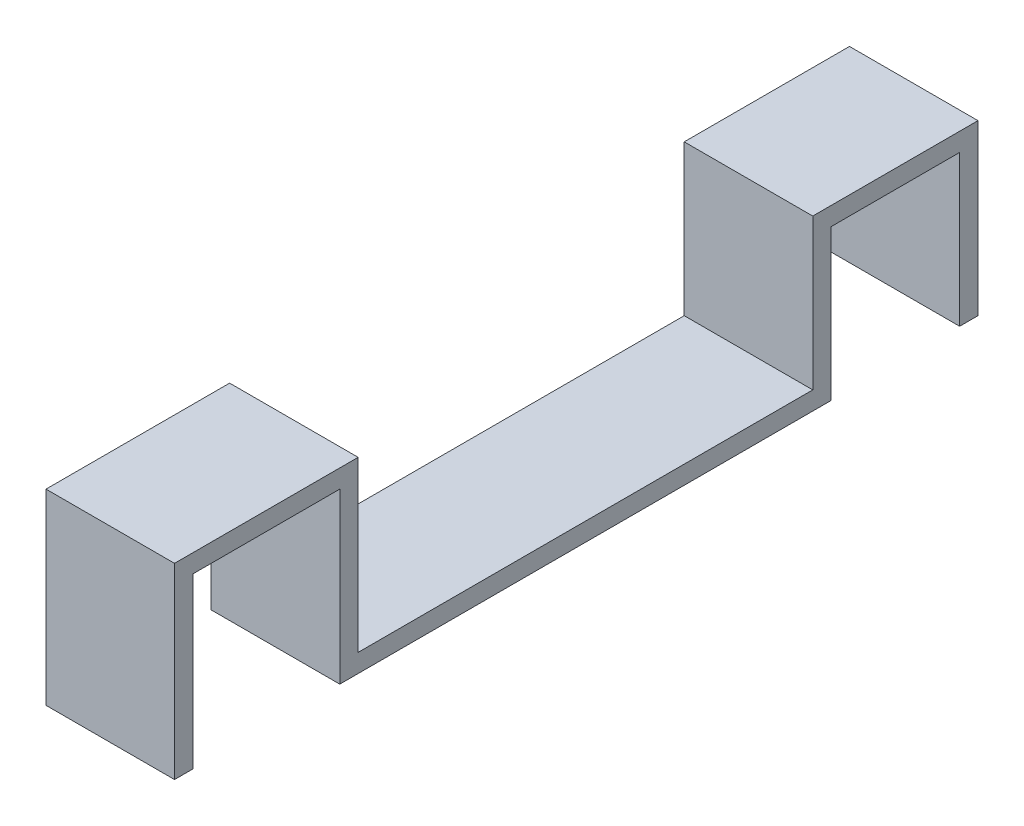
ISO-10303-21;
HEADER;
FILE_DESCRIPTION(('STEP AP214'),'2;1');
FILE_NAME('part.step','',(''),(''),'','','');
FILE_SCHEMA(('AUTOMOTIVE_DESIGN { 1 0 10303 214 1 1 1 1 }'));
ENDSEC;
DATA;
#1=APPLICATION_CONTEXT('core data for automotive mechanical design processes');
#2=APPLICATION_PROTOCOL_DEFINITION('international standard','automotive_design',2000,#1);
#3=PRODUCT_CONTEXT('',#1,'mechanical');
#4=PRODUCT('Part','Part','',(#3));
#5=PRODUCT_RELATED_PRODUCT_CATEGORY('part','',(#4));
#6=PRODUCT_DEFINITION_FORMATION('','',#4);
#7=PRODUCT_DEFINITION_CONTEXT('part definition',#1,'design');
#8=PRODUCT_DEFINITION('design','',#6,#7);
#9=PRODUCT_DEFINITION_SHAPE('','',#8);
#10=(LENGTH_UNIT() NAMED_UNIT(*) SI_UNIT(.MILLI.,.METRE.));
#11=(NAMED_UNIT(*) PLANE_ANGLE_UNIT() SI_UNIT($,.RADIAN.));
#12=(NAMED_UNIT(*) SI_UNIT($,.STERADIAN.) SOLID_ANGLE_UNIT());
#13=UNCERTAINTY_MEASURE_WITH_UNIT(LENGTH_MEASURE(1.E-05),#10,'distance_accuracy_value','');
#14=(GEOMETRIC_REPRESENTATION_CONTEXT(3) GLOBAL_UNCERTAINTY_ASSIGNED_CONTEXT((#13)) GLOBAL_UNIT_ASSIGNED_CONTEXT((#10,
#11,#12)) REPRESENTATION_CONTEXT('',''));
#15=CARTESIAN_POINT('',(0.,0.,0.));
#16=DIRECTION('',(0.,0.,1.));
#17=DIRECTION('',(1.,0.,0.));
#18=AXIS2_PLACEMENT_3D('',#15,#16,#17);
#19=CARTESIAN_POINT('',(-17.5,46.,111.9));
#20=DIRECTION('',(0.,1.,0.));
#21=DIRECTION('',(0.,0.,1.));
#22=AXIS2_PLACEMENT_3D('',#19,#20,#21);
#23=PLANE('',#22);
#24=DIRECTION('',(1.,0.,0.));
#25=VECTOR('',#24,1.);
#26=CARTESIAN_POINT('',(-17.5,46.,106.9));
#27=LINE('',#26,#25);
#28=CARTESIAN_POINT('',(-17.5,46.,106.9));
#29=VERTEX_POINT('',#28);
#30=CARTESIAN_POINT('',(17.5,46.,106.9));
#31=VERTEX_POINT('',#30);
#32=EDGE_CURVE('E172',#29,#31,#27,.T.);
#33=ORIENTED_EDGE('',*,*,#32,.F.);
#34=DIRECTION('',(0.,0.,-1.));
#35=VECTOR('',#34,1.);
#36=CARTESIAN_POINT('',(-17.5,46.,111.9));
#37=LINE('',#36,#35);
#38=CARTESIAN_POINT('',(-17.5,46.,66.9));
#39=VERTEX_POINT('',#38);
#40=EDGE_CURVE('E52',#29,#39,#37,.T.);
#41=ORIENTED_EDGE('',*,*,#40,.T.);
#42=DIRECTION('',(1.,0.,0.));
#43=VECTOR('',#42,1.);
#44=CARTESIAN_POINT('',(-17.5,46.,66.9));
#45=LINE('',#44,#43);
#46=CARTESIAN_POINT('',(17.5,46.,66.9));
#47=VERTEX_POINT('',#46);
#48=EDGE_CURVE('E177',#39,#47,#45,.T.);
#49=ORIENTED_EDGE('',*,*,#48,.T.);
#50=DIRECTION('',(0.,0.,-1.));
#51=VECTOR('',#50,1.);
#52=CARTESIAN_POINT('',(17.5,46.,111.9));
#53=LINE('',#52,#51);
#54=EDGE_CURVE('E190',#31,#47,#53,.T.);
#55=ORIENTED_EDGE('',*,*,#54,.F.);
#56=EDGE_LOOP('',(#33,#41,#49,#55));
#57=FACE_BOUND('',#56,.T.);
#58=ADVANCED_FACE('F35',(#57),#23,.F.);
#59=CARTESIAN_POINT('',(0.,0.,66.9));
#60=DIRECTION('',(0.,0.,-1.));
#61=DIRECTION('',(-1.,0.,0.));
#62=AXIS2_PLACEMENT_3D('',#59,#60,#61);
#63=PLANE('',#62);
#64=ORIENTED_EDGE('',*,*,#48,.F.);
#65=DIRECTION('',(0.,-1.,0.));
#66=VECTOR('',#65,1.);
#67=CARTESIAN_POINT('',(-17.5,0.,66.9));
#68=LINE('',#67,#66);
#69=CARTESIAN_POINT('',(-17.5,0.,66.9));
#70=VERTEX_POINT('',#69);
#71=EDGE_CURVE('E207',#39,#70,#68,.T.);
#72=ORIENTED_EDGE('',*,*,#71,.T.);
#73=DIRECTION('',(1.,0.,0.));
#74=VECTOR('',#73,1.);
#75=CARTESIAN_POINT('',(-17.5,0.,66.9));
#76=LINE('',#75,#74);
#77=CARTESIAN_POINT('',(17.5,0.,66.9));
#78=VERTEX_POINT('',#77);
#79=EDGE_CURVE('E209',#70,#78,#76,.T.);
#80=ORIENTED_EDGE('',*,*,#79,.T.);
#81=DIRECTION('',(0.,1.,0.));
#82=VECTOR('',#81,1.);
#83=CARTESIAN_POINT('',(17.5,0.,66.9));
#84=LINE('',#83,#82);
#85=EDGE_CURVE('E212',#78,#47,#84,.T.);
#86=ORIENTED_EDGE('',*,*,#85,.T.);
#87=EDGE_LOOP('',(#64,#72,#80,#86));
#88=FACE_BOUND('',#87,.T.);
#89=ADVANCED_FACE('F325',(#88),#63,.F.);
#90=CARTESIAN_POINT('',(0.,5.,0.));
#91=DIRECTION('',(0.,1.,0.));
#92=DIRECTION('',(0.,0.,1.));
#93=AXIS2_PLACEMENT_3D('',#90,#91,#92);
#94=PLANE('',#93);
#95=DIRECTION('',(0.,0.,-1.));
#96=VECTOR('',#95,1.);
#97=CARTESIAN_POINT('',(-17.5,5.,61.9));
#98=LINE('',#97,#96);
#99=CARTESIAN_POINT('',(-17.5,5.,61.9));
#100=VERTEX_POINT('',#99);
#101=CARTESIAN_POINT('',(-17.5,5.,-61.9));
#102=VERTEX_POINT('',#101);
#103=EDGE_CURVE('E11',#100,#102,#98,.T.);
#104=ORIENTED_EDGE('',*,*,#103,.F.);
#105=DIRECTION('',(-1.,0.,0.));
#106=VECTOR('',#105,1.);
#107=CARTESIAN_POINT('',(-17.5,5.,61.9));
#108=LINE('',#107,#106);
#109=CARTESIAN_POINT('',(17.5,5.,61.9));
#110=VERTEX_POINT('',#109);
#111=EDGE_CURVE('E194',#110,#100,#108,.T.);
#112=ORIENTED_EDGE('',*,*,#111,.F.);
#113=DIRECTION('',(0.,0.,-1.));
#114=VECTOR('',#113,1.);
#115=CARTESIAN_POINT('',(17.5,5.,61.9));
#116=LINE('',#115,#114);
#117=CARTESIAN_POINT('',(17.5,5.,-61.9));
#118=VERTEX_POINT('',#117);
#119=EDGE_CURVE('E44',#110,#118,#116,.T.);
#120=ORIENTED_EDGE('',*,*,#119,.T.);
#121=DIRECTION('',(1.,0.,0.));
#122=VECTOR('',#121,1.);
#123=CARTESIAN_POINT('',(0.,5.,-61.9));
#124=LINE('',#123,#122);
#125=EDGE_CURVE('E255',#102,#118,#124,.T.);
#126=ORIENTED_EDGE('',*,*,#125,.F.);
#127=EDGE_LOOP('',(#104,#112,#120,#126));
#128=FACE_BOUND('',#127,.T.);
#129=ADVANCED_FACE('F308',(#128),#94,.T.);
#130=CARTESIAN_POINT('',(17.5,5.,61.9));
#131=DIRECTION('',(-1.,0.,0.));
#132=DIRECTION('',(0.,0.,1.));
#133=AXIS2_PLACEMENT_3D('',#130,#131,#132);
#134=PLANE('',#133);
#135=DIRECTION('',(0.,0.,-1.));
#136=VECTOR('',#135,1.);
#137=CARTESIAN_POINT('',(17.5,0.,61.9));
#138=LINE('',#137,#136);
#139=CARTESIAN_POINT('',(17.5,0.,-66.9));
#140=VERTEX_POINT('',#139);
#141=EDGE_CURVE('E270',#78,#140,#138,.T.);
#142=ORIENTED_EDGE('',*,*,#141,.T.);
#143=DIRECTION('',(0.,-1.,0.));
#144=VECTOR('',#143,1.);
#145=CARTESIAN_POINT('',(17.5,5.,-66.9));
#146=LINE('',#145,#144);
#147=CARTESIAN_POINT('',(17.5,41.,-66.9));
#148=VERTEX_POINT('',#147);
#149=EDGE_CURVE('E262',#148,#140,#146,.T.);
#150=ORIENTED_EDGE('',*,*,#149,.F.);
#151=DIRECTION('',(0.,0.,1.));
#152=VECTOR('',#151,1.);
#153=CARTESIAN_POINT('',(17.5,41.,-106.9));
#154=LINE('',#153,#152);
#155=CARTESIAN_POINT('',(17.5,41.,-101.9));
#156=VERTEX_POINT('',#155);
#157=EDGE_CURVE('E60',#156,#148,#154,.T.);
#158=ORIENTED_EDGE('',*,*,#157,.F.);
#159=DIRECTION('',(0.,1.,0.));
#160=VECTOR('',#159,1.);
#161=CARTESIAN_POINT('',(17.5,0.,-101.9));
#162=LINE('',#161,#160);
#163=CARTESIAN_POINT('',(17.5,0.,-101.9));
#164=VERTEX_POINT('',#163);
#165=EDGE_CURVE('E230',#164,#156,#162,.T.);
#166=ORIENTED_EDGE('',*,*,#165,.F.);
#167=DIRECTION('',(0.,0.,-1.));
#168=VECTOR('',#167,1.);
#169=CARTESIAN_POINT('',(17.5,0.,-101.9));
#170=LINE('',#169,#168);
#171=CARTESIAN_POINT('',(17.5,0.,-106.9));
#172=VERTEX_POINT('',#171);
#173=EDGE_CURVE('E216',#164,#172,#170,.T.);
#174=ORIENTED_EDGE('',*,*,#173,.T.);
#175=DIRECTION('',(0.,-1.,0.));
#176=VECTOR('',#175,1.);
#177=CARTESIAN_POINT('',(17.5,46.,-106.9));
#178=LINE('',#177,#176);
#179=CARTESIAN_POINT('',(17.5,46.,-106.9));
#180=VERTEX_POINT('',#179);
#181=EDGE_CURVE('E237',#180,#172,#178,.T.);
#182=ORIENTED_EDGE('',*,*,#181,.F.);
#183=DIRECTION('',(0.,0.,1.));
#184=VECTOR('',#183,1.);
#185=CARTESIAN_POINT('',(17.5,46.,-66.9));
#186=LINE('',#185,#184);
#187=CARTESIAN_POINT('',(17.5,46.,-61.9));
#188=VERTEX_POINT('',#187);
#189=EDGE_CURVE('E258',#180,#188,#186,.T.);
#190=ORIENTED_EDGE('',*,*,#189,.T.);
#191=DIRECTION('',(0.,1.,0.));
#192=VECTOR('',#191,1.);
#193=CARTESIAN_POINT('',(17.5,0.,-61.9));
#194=LINE('',#193,#192);
#195=EDGE_CURVE('E252',#118,#188,#194,.T.);
#196=ORIENTED_EDGE('',*,*,#195,.F.);
#197=ORIENTED_EDGE('',*,*,#119,.F.);
#198=DIRECTION('',(0.,-1.,0.));
#199=VECTOR('',#198,1.);
#200=CARTESIAN_POINT('',(17.5,51.,61.9));
#201=LINE('',#200,#199);
#202=CARTESIAN_POINT('',(17.5,51.,61.9));
#203=VERTEX_POINT('',#202);
#204=EDGE_CURVE('E205',#203,#110,#201,.T.);
#205=ORIENTED_EDGE('',*,*,#204,.F.);
#206=DIRECTION('',(0.,0.,-1.));
#207=VECTOR('',#206,1.);
#208=CARTESIAN_POINT('',(17.5,51.,61.9));
#209=LINE('',#208,#207);
#210=CARTESIAN_POINT('',(17.5,51.,111.9));
#211=VERTEX_POINT('',#210);
#212=EDGE_CURVE('E195',#211,#203,#209,.T.);
#213=ORIENTED_EDGE('',*,*,#212,.F.);
#214=DIRECTION('',(0.,1.,0.));
#215=VECTOR('',#214,1.);
#216=CARTESIAN_POINT('',(17.5,46.,111.9));
#217=LINE('',#216,#215);
#218=CARTESIAN_POINT('',(17.5,0.,111.9));
#219=VERTEX_POINT('',#218);
#220=EDGE_CURVE('E188',#219,#211,#217,.T.);
#221=ORIENTED_EDGE('',*,*,#220,.F.);
#222=DIRECTION('',(0.,0.,1.));
#223=VECTOR('',#222,1.);
#224=CARTESIAN_POINT('',(17.5,0.,111.9));
#225=LINE('',#224,#223);
#226=CARTESIAN_POINT('',(17.5,0.,106.9));
#227=VERTEX_POINT('',#226);
#228=EDGE_CURVE('E162',#227,#219,#225,.T.);
#229=ORIENTED_EDGE('',*,*,#228,.F.);
#230=DIRECTION('',(0.,1.,0.));
#231=VECTOR('',#230,1.);
#232=CARTESIAN_POINT('',(17.5,0.,106.9));
#233=LINE('',#232,#231);
#234=EDGE_CURVE('E158',#227,#31,#233,.T.);
#235=ORIENTED_EDGE('',*,*,#234,.T.);
#236=ORIENTED_EDGE('',*,*,#54,.T.);
#237=ORIENTED_EDGE('',*,*,#85,.F.);
#238=EDGE_LOOP('',(#142,#150,#158,#166,#174,#182,#190,#196,#197,#205,#213,#221,#229,#235,#236,#237));
#239=FACE_BOUND('',#238,.T.);
#240=ADVANCED_FACE('F37',(#239),#134,.F.);
#241=CARTESIAN_POINT('',(-17.5,5.,61.9));
#242=DIRECTION('',(-1.,0.,0.));
#243=DIRECTION('',(0.,0.,1.));
#244=AXIS2_PLACEMENT_3D('',#241,#242,#243);
#245=PLANE('',#244);
#246=DIRECTION('',(0.,0.,-1.));
#247=VECTOR('',#246,1.);
#248=CARTESIAN_POINT('',(-17.5,0.,61.9));
#249=LINE('',#248,#247);
#250=CARTESIAN_POINT('',(-17.5,0.,-66.9));
#251=VERTEX_POINT('',#250);
#252=EDGE_CURVE('E39',#70,#251,#249,.T.);
#253=ORIENTED_EDGE('',*,*,#252,.F.);
#254=ORIENTED_EDGE('',*,*,#71,.F.);
#255=ORIENTED_EDGE('',*,*,#40,.F.);
#256=DIRECTION('',(0.,1.,0.));
#257=VECTOR('',#256,1.);
#258=CARTESIAN_POINT('',(-17.5,0.,106.9));
#259=LINE('',#258,#257);
#260=CARTESIAN_POINT('',(-17.5,0.,106.9));
#261=VERTEX_POINT('',#260);
#262=EDGE_CURVE('E156',#261,#29,#259,.T.);
#263=ORIENTED_EDGE('',*,*,#262,.F.);
#264=DIRECTION('',(0.,0.,-1.));
#265=VECTOR('',#264,1.);
#266=CARTESIAN_POINT('',(-17.5,0.,111.9));
#267=LINE('',#266,#265);
#268=CARTESIAN_POINT('',(-17.5,0.,111.9));
#269=VERTEX_POINT('',#268);
#270=EDGE_CURVE('E163',#269,#261,#267,.T.);
#271=ORIENTED_EDGE('',*,*,#270,.F.);
#272=DIRECTION('',(0.,-1.,0.));
#273=VECTOR('',#272,1.);
#274=CARTESIAN_POINT('',(-17.5,51.,111.9));
#275=LINE('',#274,#273);
#276=CARTESIAN_POINT('',(-17.5,51.,111.9));
#277=VERTEX_POINT('',#276);
#278=EDGE_CURVE('E186',#277,#269,#275,.T.);
#279=ORIENTED_EDGE('',*,*,#278,.F.);
#280=DIRECTION('',(0.,0.,1.));
#281=VECTOR('',#280,1.);
#282=CARTESIAN_POINT('',(-17.5,51.,66.9));
#283=LINE('',#282,#281);
#284=CARTESIAN_POINT('',(-17.5,51.,61.9));
#285=VERTEX_POINT('',#284);
#286=EDGE_CURVE('E199',#285,#277,#283,.T.);
#287=ORIENTED_EDGE('',*,*,#286,.F.);
#288=DIRECTION('',(0.,-1.,0.));
#289=VECTOR('',#288,1.);
#290=CARTESIAN_POINT('',(-17.5,51.,61.9));
#291=LINE('',#290,#289);
#292=EDGE_CURVE('E201',#285,#100,#291,.T.);
#293=ORIENTED_EDGE('',*,*,#292,.T.);
#294=ORIENTED_EDGE('',*,*,#103,.T.);
#295=DIRECTION('',(0.,-1.,0.));
#296=VECTOR('',#295,1.);
#297=CARTESIAN_POINT('',(-17.5,0.,-61.9));
#298=LINE('',#297,#296);
#299=CARTESIAN_POINT('',(-17.5,46.,-61.9));
#300=VERTEX_POINT('',#299);
#301=EDGE_CURVE('E246',#300,#102,#298,.T.);
#302=ORIENTED_EDGE('',*,*,#301,.F.);
#303=DIRECTION('',(0.,0.,1.));
#304=VECTOR('',#303,1.);
#305=CARTESIAN_POINT('',(-17.5,46.,-66.9));
#306=LINE('',#305,#304);
#307=CARTESIAN_POINT('',(-17.5,46.,-106.9));
#308=VERTEX_POINT('',#307);
#309=EDGE_CURVE('E260',#308,#300,#306,.T.);
#310=ORIENTED_EDGE('',*,*,#309,.F.);
#311=DIRECTION('',(0.,1.,0.));
#312=VECTOR('',#311,1.);
#313=CARTESIAN_POINT('',(-17.5,41.,-106.9));
#314=LINE('',#313,#312);
#315=CARTESIAN_POINT('',(-17.5,0.,-106.9));
#316=VERTEX_POINT('',#315);
#317=EDGE_CURVE('E239',#316,#308,#314,.T.);
#318=ORIENTED_EDGE('',*,*,#317,.F.);
#319=DIRECTION('',(0.,0.,1.));
#320=VECTOR('',#319,1.);
#321=CARTESIAN_POINT('',(-17.5,0.,-106.9));
#322=LINE('',#321,#320);
#323=CARTESIAN_POINT('',(-17.5,0.,-101.9));
#324=VERTEX_POINT('',#323);
#325=EDGE_CURVE('E222',#316,#324,#322,.T.);
#326=ORIENTED_EDGE('',*,*,#325,.T.);
#327=DIRECTION('',(0.,1.,0.));
#328=VECTOR('',#327,1.);
#329=CARTESIAN_POINT('',(-17.5,0.,-101.9));
#330=LINE('',#329,#328);
#331=CARTESIAN_POINT('',(-17.5,41.,-101.9));
#332=VERTEX_POINT('',#331);
#333=EDGE_CURVE('E228',#324,#332,#330,.T.);
#334=ORIENTED_EDGE('',*,*,#333,.T.);
#335=DIRECTION('',(0.,0.,1.));
#336=VECTOR('',#335,1.);
#337=CARTESIAN_POINT('',(-17.5,41.,-106.9));
#338=LINE('',#337,#336);
#339=CARTESIAN_POINT('',(-17.5,41.,-66.9));
#340=VERTEX_POINT('',#339);
#341=EDGE_CURVE('E242',#332,#340,#338,.T.);
#342=ORIENTED_EDGE('',*,*,#341,.T.);
#343=DIRECTION('',(0.,1.,0.));
#344=VECTOR('',#343,1.);
#345=CARTESIAN_POINT('',(-17.5,5.,-66.9));
#346=LINE('',#345,#344);
#347=EDGE_CURVE('E267',#251,#340,#346,.T.);
#348=ORIENTED_EDGE('',*,*,#347,.F.);
#349=EDGE_LOOP('',(#253,#254,#255,#263,#271,#279,#287,#293,#294,#302,#310,#318,#326,#334,#342,#348));
#350=FACE_BOUND('',#349,.T.);
#351=ADVANCED_FACE('F175',(#350),#245,.T.);
#352=CARTESIAN_POINT('',(0.,0.,0.));
#353=DIRECTION('',(0.,1.,0.));
#354=DIRECTION('',(0.,0.,1.));
#355=AXIS2_PLACEMENT_3D('',#352,#353,#354);
#356=PLANE('',#355);
#357=ORIENTED_EDGE('',*,*,#141,.F.);
#358=ORIENTED_EDGE('',*,*,#79,.F.);
#359=ORIENTED_EDGE('',*,*,#252,.T.);
#360=DIRECTION('',(-1.,0.,0.));
#361=VECTOR('',#360,1.);
#362=CARTESIAN_POINT('',(17.5,0.,-66.9));
#363=LINE('',#362,#361);
#364=EDGE_CURVE('E264',#140,#251,#363,.T.);
#365=ORIENTED_EDGE('',*,*,#364,.F.);
#366=EDGE_LOOP('',(#357,#358,#359,#365));
#367=FACE_BOUND('',#366,.T.);
#368=ADVANCED_FACE('F278',(#367),#356,.F.);
#369=CARTESIAN_POINT('',(0.,0.,-66.9));
#370=DIRECTION('',(0.,0.,-1.));
#371=DIRECTION('',(-1.,0.,0.));
#372=AXIS2_PLACEMENT_3D('',#369,#370,#371);
#373=PLANE('',#372);
#374=DIRECTION('',(-1.,0.,0.));
#375=VECTOR('',#374,1.);
#376=CARTESIAN_POINT('',(17.5,41.,-66.9));
#377=LINE('',#376,#375);
#378=EDGE_CURVE('E232',#148,#340,#377,.T.);
#379=ORIENTED_EDGE('',*,*,#378,.F.);
#380=ORIENTED_EDGE('',*,*,#149,.T.);
#381=ORIENTED_EDGE('',*,*,#364,.T.);
#382=ORIENTED_EDGE('',*,*,#347,.T.);
#383=EDGE_LOOP('',(#379,#380,#381,#382));
#384=FACE_BOUND('',#383,.T.);
#385=ADVANCED_FACE('F281',(#384),#373,.T.);
#386=CARTESIAN_POINT('',(0.,46.,-66.9));
#387=DIRECTION('',(0.,1.,0.));
#388=DIRECTION('',(0.,0.,1.));
#389=AXIS2_PLACEMENT_3D('',#386,#387,#388);
#390=PLANE('',#389);
#391=DIRECTION('',(-1.,0.,0.));
#392=VECTOR('',#391,1.);
#393=CARTESIAN_POINT('',(0.,46.,-61.9));
#394=LINE('',#393,#392);
#395=EDGE_CURVE('E249',#188,#300,#394,.T.);
#396=ORIENTED_EDGE('',*,*,#395,.F.);
#397=ORIENTED_EDGE('',*,*,#189,.F.);
#398=DIRECTION('',(1.,0.,0.));
#399=VECTOR('',#398,1.);
#400=CARTESIAN_POINT('',(-17.5,46.,-106.9));
#401=LINE('',#400,#399);
#402=EDGE_CURVE('E234',#308,#180,#401,.T.);
#403=ORIENTED_EDGE('',*,*,#402,.F.);
#404=ORIENTED_EDGE('',*,*,#309,.T.);
#405=EDGE_LOOP('',(#396,#397,#403,#404));
#406=FACE_BOUND('',#405,.T.);
#407=ADVANCED_FACE('F301',(#406),#390,.T.);
#408=CARTESIAN_POINT('',(0.,0.,-61.9));
#409=DIRECTION('',(0.,0.,-1.));
#410=DIRECTION('',(-1.,0.,0.));
#411=AXIS2_PLACEMENT_3D('',#408,#409,#410);
#412=PLANE('',#411);
#413=ORIENTED_EDGE('',*,*,#301,.T.);
#414=ORIENTED_EDGE('',*,*,#125,.T.);
#415=ORIENTED_EDGE('',*,*,#195,.T.);
#416=ORIENTED_EDGE('',*,*,#395,.T.);
#417=EDGE_LOOP('',(#413,#414,#415,#416));
#418=FACE_BOUND('',#417,.T.);
#419=ADVANCED_FACE('F304',(#418),#412,.F.);
#420=CARTESIAN_POINT('',(17.5,41.,-106.9));
#421=DIRECTION('',(0.,1.,0.));
#422=DIRECTION('',(0.,0.,1.));
#423=AXIS2_PLACEMENT_3D('',#420,#421,#422);
#424=PLANE('',#423);
#425=ORIENTED_EDGE('',*,*,#341,.F.);
#426=DIRECTION('',(1.,0.,0.));
#427=VECTOR('',#426,1.);
#428=CARTESIAN_POINT('',(-17.5,41.,-101.9));
#429=LINE('',#428,#427);
#430=EDGE_CURVE('E215',#332,#156,#429,.T.);
#431=ORIENTED_EDGE('',*,*,#430,.T.);
#432=ORIENTED_EDGE('',*,*,#157,.T.);
#433=ORIENTED_EDGE('',*,*,#378,.T.);
#434=EDGE_LOOP('',(#425,#431,#432,#433));
#435=FACE_BOUND('',#434,.T.);
#436=ADVANCED_FACE('F284',(#435),#424,.F.);
#437=CARTESIAN_POINT('',(0.,0.,-106.9));
#438=DIRECTION('',(0.,0.,-1.));
#439=DIRECTION('',(-1.,0.,0.));
#440=AXIS2_PLACEMENT_3D('',#437,#438,#439);
#441=PLANE('',#440);
#442=ORIENTED_EDGE('',*,*,#402,.T.);
#443=ORIENTED_EDGE('',*,*,#181,.T.);
#444=DIRECTION('',(-1.,0.,0.));
#445=VECTOR('',#444,1.);
#446=CARTESIAN_POINT('',(17.5,0.,-106.9));
#447=LINE('',#446,#445);
#448=EDGE_CURVE('E219',#172,#316,#447,.T.);
#449=ORIENTED_EDGE('',*,*,#448,.T.);
#450=ORIENTED_EDGE('',*,*,#317,.T.);
#451=EDGE_LOOP('',(#442,#443,#449,#450));
#452=FACE_BOUND('',#451,.T.);
#453=ADVANCED_FACE('F295',(#452),#441,.T.);
#454=CARTESIAN_POINT('',(-17.5,0.,-101.9));
#455=DIRECTION('',(0.,0.,1.));
#456=DIRECTION('',(1.,0.,0.));
#457=AXIS2_PLACEMENT_3D('',#454,#455,#456);
#458=PLANE('',#457);
#459=ORIENTED_EDGE('',*,*,#430,.F.);
#460=ORIENTED_EDGE('',*,*,#333,.F.);
#461=DIRECTION('',(1.,0.,0.));
#462=VECTOR('',#461,1.);
#463=CARTESIAN_POINT('',(-17.5,0.,-101.9));
#464=LINE('',#463,#462);
#465=EDGE_CURVE('E225',#324,#164,#464,.T.);
#466=ORIENTED_EDGE('',*,*,#465,.T.);
#467=ORIENTED_EDGE('',*,*,#165,.T.);
#468=EDGE_LOOP('',(#459,#460,#466,#467));
#469=FACE_BOUND('',#468,.T.);
#470=ADVANCED_FACE('F293',(#469),#458,.T.);
#471=CARTESIAN_POINT('',(0.,0.,0.));
#472=DIRECTION('',(0.,1.,0.));
#473=DIRECTION('',(0.,0.,1.));
#474=AXIS2_PLACEMENT_3D('',#471,#472,#473);
#475=PLANE('',#474);
#476=ORIENTED_EDGE('',*,*,#173,.F.);
#477=ORIENTED_EDGE('',*,*,#465,.F.);
#478=ORIENTED_EDGE('',*,*,#325,.F.);
#479=ORIENTED_EDGE('',*,*,#448,.F.);
#480=EDGE_LOOP('',(#476,#477,#478,#479));
#481=FACE_BOUND('',#480,.T.);
#482=ADVANCED_FACE('F291',(#481),#475,.F.);
#483=CARTESIAN_POINT('',(-17.5,51.,61.9));
#484=DIRECTION('',(0.,0.,1.));
#485=DIRECTION('',(1.,0.,0.));
#486=AXIS2_PLACEMENT_3D('',#483,#484,#485);
#487=PLANE('',#486);
#488=ORIENTED_EDGE('',*,*,#111,.T.);
#489=ORIENTED_EDGE('',*,*,#292,.F.);
#490=DIRECTION('',(-1.,0.,0.));
#491=VECTOR('',#490,1.);
#492=CARTESIAN_POINT('',(-17.5,51.,61.9));
#493=LINE('',#492,#491);
#494=EDGE_CURVE('E197',#203,#285,#493,.T.);
#495=ORIENTED_EDGE('',*,*,#494,.F.);
#496=ORIENTED_EDGE('',*,*,#204,.T.);
#497=EDGE_LOOP('',(#488,#489,#495,#496));
#498=FACE_BOUND('',#497,.T.);
#499=ADVANCED_FACE('F314',(#498),#487,.F.);
#500=CARTESIAN_POINT('',(0.,51.,0.));
#501=DIRECTION('',(0.,-1.,0.));
#502=DIRECTION('',(0.,0.,-1.));
#503=AXIS2_PLACEMENT_3D('',#500,#501,#502);
#504=PLANE('',#503);
#505=ORIENTED_EDGE('',*,*,#286,.T.);
#506=DIRECTION('',(-1.,0.,0.));
#507=VECTOR('',#506,1.);
#508=CARTESIAN_POINT('',(17.5,51.,111.9));
#509=LINE('',#508,#507);
#510=EDGE_CURVE('E179',#211,#277,#509,.T.);
#511=ORIENTED_EDGE('',*,*,#510,.F.);
#512=ORIENTED_EDGE('',*,*,#212,.T.);
#513=ORIENTED_EDGE('',*,*,#494,.T.);
#514=EDGE_LOOP('',(#505,#511,#512,#513));
#515=FACE_BOUND('',#514,.T.);
#516=ADVANCED_FACE('F317',(#515),#504,.F.);
#517=CARTESIAN_POINT('',(0.,0.,111.9));
#518=DIRECTION('',(0.,0.,1.));
#519=DIRECTION('',(1.,0.,0.));
#520=AXIS2_PLACEMENT_3D('',#517,#518,#519);
#521=PLANE('',#520);
#522=ORIENTED_EDGE('',*,*,#510,.T.);
#523=ORIENTED_EDGE('',*,*,#278,.T.);
#524=DIRECTION('',(-1.,0.,0.));
#525=VECTOR('',#524,1.);
#526=CARTESIAN_POINT('',(-17.5,0.,111.9));
#527=LINE('',#526,#525);
#528=EDGE_CURVE('E169',#219,#269,#527,.T.);
#529=ORIENTED_EDGE('',*,*,#528,.F.);
#530=ORIENTED_EDGE('',*,*,#220,.T.);
#531=EDGE_LOOP('',(#522,#523,#529,#530));
#532=FACE_BOUND('',#531,.T.);
#533=ADVANCED_FACE('F320',(#532),#521,.T.);
#534=CARTESIAN_POINT('',(-17.5,0.,106.9));
#535=DIRECTION('',(0.,0.,1.));
#536=DIRECTION('',(1.,0.,0.));
#537=AXIS2_PLACEMENT_3D('',#534,#535,#536);
#538=PLANE('',#537);
#539=ORIENTED_EDGE('',*,*,#32,.T.);
#540=ORIENTED_EDGE('',*,*,#234,.F.);
#541=DIRECTION('',(1.,0.,0.));
#542=VECTOR('',#541,1.);
#543=CARTESIAN_POINT('',(-17.5,0.,106.9));
#544=LINE('',#543,#542);
#545=EDGE_CURVE('E152',#261,#227,#544,.T.);
#546=ORIENTED_EDGE('',*,*,#545,.F.);
#547=ORIENTED_EDGE('',*,*,#262,.T.);
#548=EDGE_LOOP('',(#539,#540,#546,#547));
#549=FACE_BOUND('',#548,.T.);
#550=ADVANCED_FACE('F154',(#549),#538,.F.);
#551=CARTESIAN_POINT('',(0.,0.,0.));
#552=DIRECTION('',(0.,-1.,0.));
#553=DIRECTION('',(0.,0.,-1.));
#554=AXIS2_PLACEMENT_3D('',#551,#552,#553);
#555=PLANE('',#554);
#556=ORIENTED_EDGE('',*,*,#270,.T.);
#557=ORIENTED_EDGE('',*,*,#545,.T.);
#558=ORIENTED_EDGE('',*,*,#228,.T.);
#559=ORIENTED_EDGE('',*,*,#528,.T.);
#560=EDGE_LOOP('',(#556,#557,#558,#559));
#561=FACE_BOUND('',#560,.T.);
#562=ADVANCED_FACE('F167',(#561),#555,.T.);
#563=CLOSED_SHELL('',(#58,#89,#129,#240,#351,#368,#385,#407,#419,#436,#453,#470,#482,#499,#516,
#533,#550,#562));
#564=MANIFOLD_SOLID_BREP('B2',#563);
#565=ADVANCED_BREP_SHAPE_REPRESENTATION('',(#18,#564),#14);
#566=SHAPE_DEFINITION_REPRESENTATION(#9,#565);
ENDSEC;
END-ISO-10303-21;
